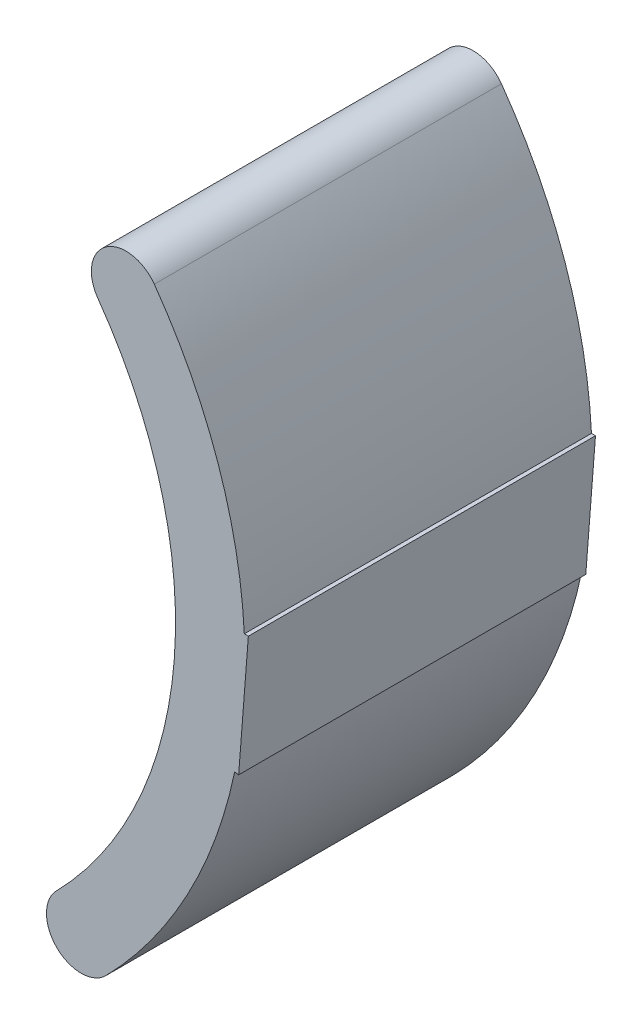
ISO-10303-21;
HEADER;
FILE_DESCRIPTION(('STEP AP214'),'2;1');
FILE_NAME('part.step','',(''),(''),'','','');
FILE_SCHEMA(('AUTOMOTIVE_DESIGN { 1 0 10303 214 1 1 1 1 }'));
ENDSEC;
DATA;
#1=APPLICATION_CONTEXT('core data for automotive mechanical design processes');
#2=APPLICATION_PROTOCOL_DEFINITION('international standard','automotive_design',2000,#1);
#3=PRODUCT_CONTEXT('',#1,'mechanical');
#4=PRODUCT('Part','Part','',(#3));
#5=PRODUCT_RELATED_PRODUCT_CATEGORY('part','',(#4));
#6=PRODUCT_DEFINITION_FORMATION('','',#4);
#7=PRODUCT_DEFINITION_CONTEXT('part definition',#1,'design');
#8=PRODUCT_DEFINITION('design','',#6,#7);
#9=PRODUCT_DEFINITION_SHAPE('','',#8);
#10=(LENGTH_UNIT() NAMED_UNIT(*) SI_UNIT(.MILLI.,.METRE.));
#11=(NAMED_UNIT(*) PLANE_ANGLE_UNIT() SI_UNIT($,.RADIAN.));
#12=(NAMED_UNIT(*) SI_UNIT($,.STERADIAN.) SOLID_ANGLE_UNIT());
#13=UNCERTAINTY_MEASURE_WITH_UNIT(LENGTH_MEASURE(1.E-05),#10,'distance_accuracy_value','');
#14=(GEOMETRIC_REPRESENTATION_CONTEXT(3) GLOBAL_UNCERTAINTY_ASSIGNED_CONTEXT((#13)) GLOBAL_UNIT_ASSIGNED_CONTEXT((#10,
#11,#12)) REPRESENTATION_CONTEXT('',''));
#15=CARTESIAN_POINT('',(0.,0.,0.));
#16=DIRECTION('',(0.,0.,1.));
#17=DIRECTION('',(1.,0.,0.));
#18=AXIS2_PLACEMENT_3D('',#15,#16,#17);
#19=CARTESIAN_POINT('',(46.4110109557855,-45.5084394597524,50.));
#20=DIRECTION('',(0.,0.,-1.));
#21=DIRECTION('',(-1.,0.,0.));
#22=AXIS2_PLACEMENT_3D('',#19,#20,#21);
#23=CYLINDRICAL_SURFACE('',#22,5.);
#24=CARTESIAN_POINT('',(46.4110109557855,-45.5084394597524,0.));
#25=DIRECTION('',(0.,0.,1.));
#26=DIRECTION('',(1.,0.,0.));
#27=AXIS2_PLACEMENT_3D('',#24,#25,#26);
#28=CIRCLE('',#27,5.);
#29=CARTESIAN_POINT('',(42.8409331899559,-42.0077902705407,0.));
#30=VERTEX_POINT('',#29);
#31=CARTESIAN_POINT('',(49.9810887216152,-49.0090886489642,0.));
#32=VERTEX_POINT('',#31);
#33=EDGE_CURVE('E140',#30,#32,#28,.T.);
#34=ORIENTED_EDGE('',*,*,#33,.T.);
#35=DIRECTION('',(0.,0.,-1.));
#36=VECTOR('',#35,1.);
#37=CARTESIAN_POINT('',(49.9810887216152,-49.0090886489642,50.));
#38=LINE('',#37,#36);
#39=CARTESIAN_POINT('',(49.9810887216152,-49.0090886489642,50.));
#40=VERTEX_POINT('',#39);
#41=EDGE_CURVE('E11',#40,#32,#38,.T.);
#42=ORIENTED_EDGE('',*,*,#41,.F.);
#43=CARTESIAN_POINT('',(46.4110109557855,-45.5084394597524,50.));
#44=DIRECTION('',(0.,0.,1.));
#45=DIRECTION('',(1.,0.,0.));
#46=AXIS2_PLACEMENT_3D('',#43,#44,#45);
#47=CIRCLE('',#46,5.);
#48=CARTESIAN_POINT('',(42.8409331899559,-42.0077902705407,50.));
#49=VERTEX_POINT('',#48);
#50=EDGE_CURVE('E162',#49,#40,#47,.T.);
#51=ORIENTED_EDGE('',*,*,#50,.F.);
#52=DIRECTION('',(0.,0.,-1.));
#53=VECTOR('',#52,1.);
#54=CARTESIAN_POINT('',(42.8409331899559,-42.0077902705407,50.));
#55=LINE('',#54,#53);
#56=EDGE_CURVE('E136',#49,#30,#55,.T.);
#57=ORIENTED_EDGE('',*,*,#56,.T.);
#58=EDGE_LOOP('',(#34,#42,#51,#57));
#59=FACE_BOUND('',#58,.T.);
#60=ADVANCED_FACE('F39',(#59),#23,.T.);
#61=CARTESIAN_POINT('',(0.,0.,50.));
#62=DIRECTION('',(0.,0.,-1.));
#63=DIRECTION('',(-1.,0.,0.));
#64=AXIS2_PLACEMENT_3D('',#61,#62,#63);
#65=CYLINDRICAL_SURFACE('',#64,70.);
#66=CARTESIAN_POINT('',(0.,0.,0.));
#67=DIRECTION('',(0.,0.,1.));
#68=DIRECTION('',(1.,0.,0.));
#69=AXIS2_PLACEMENT_3D('',#66,#67,#68);
#70=CIRCLE('',#69,70.);
#71=CARTESIAN_POINT('',(68.5182827752891,-14.3263716804193,0.));
#72=VERTEX_POINT('',#71);
#73=EDGE_CURVE('E144',#32,#72,#70,.T.);
#74=ORIENTED_EDGE('',*,*,#73,.T.);
#75=DIRECTION('',(0.,0.,-1.));
#76=VECTOR('',#75,1.);
#77=CARTESIAN_POINT('',(68.5182827752891,-14.3263716804193,50.));
#78=LINE('',#77,#76);
#79=CARTESIAN_POINT('',(68.5182827752891,-14.3263716804193,50.));
#80=VERTEX_POINT('',#79);
#81=EDGE_CURVE('E48',#80,#72,#78,.T.);
#82=ORIENTED_EDGE('',*,*,#81,.F.);
#83=CARTESIAN_POINT('',(0.,0.,50.));
#84=DIRECTION('',(0.,0.,1.));
#85=DIRECTION('',(1.,0.,0.));
#86=AXIS2_PLACEMENT_3D('',#83,#84,#85);
#87=CIRCLE('',#86,70.);
#88=EDGE_CURVE('E99',#40,#80,#87,.T.);
#89=ORIENTED_EDGE('',*,*,#88,.F.);
#90=ORIENTED_EDGE('',*,*,#41,.T.);
#91=EDGE_LOOP('',(#74,#82,#89,#90));
#92=FACE_BOUND('',#91,.T.);
#93=ADVANCED_FACE('F208',(#92),#65,.T.);
#94=CARTESIAN_POINT('',(69.0917446541184,-14.4159154729665,50.));
#95=DIRECTION('',(0.154276597047051,0.988027697791707,0.));
#96=DIRECTION('',(-0.988027697791708,0.154276597047051,0.));
#97=AXIS2_PLACEMENT_3D('',#94,#95,#96);
#98=PLANE('',#97);
#99=DIRECTION('',(0.988027697791707,-0.154276597047051,0.));
#100=VECTOR('',#99,1.);
#101=CARTESIAN_POINT('',(69.0917446541184,-14.4159154729665,0.));
#102=LINE('',#101,#100);
#103=CARTESIAN_POINT('',(69.0917446541184,-14.4159154729665,0.));
#104=VERTEX_POINT('',#103);
#105=EDGE_CURVE('E147',#72,#104,#102,.T.);
#106=ORIENTED_EDGE('',*,*,#105,.T.);
#107=DIRECTION('',(0.,0.,-1.));
#108=VECTOR('',#107,1.);
#109=CARTESIAN_POINT('',(69.0917446541184,-14.4159154729665,50.));
#110=LINE('',#109,#108);
#111=CARTESIAN_POINT('',(69.0917446541184,-14.4159154729665,50.));
#112=VERTEX_POINT('',#111);
#113=EDGE_CURVE('E173',#112,#104,#110,.T.);
#114=ORIENTED_EDGE('',*,*,#113,.F.);
#115=DIRECTION('',(0.988027697791707,-0.154276597047051,0.));
#116=VECTOR('',#115,1.);
#117=CARTESIAN_POINT('',(69.0917446541184,-14.4159154729665,50.));
#118=LINE('',#117,#116);
#119=EDGE_CURVE('E183',#80,#112,#118,.T.);
#120=ORIENTED_EDGE('',*,*,#119,.F.);
#121=ORIENTED_EDGE('',*,*,#81,.T.);
#122=EDGE_LOOP('',(#106,#114,#120,#121));
#123=FACE_BOUND('',#122,.T.);
#124=ADVANCED_FACE('F181',(#123),#98,.F.);
#125=CARTESIAN_POINT('',(69.0917446541184,-14.4159154729665,50.));
#126=DIRECTION('',(-0.997002431740191,0.0773702210423787,0.));
#127=DIRECTION('',(-0.0773702210423787,-0.997002431740191,0.));
#128=AXIS2_PLACEMENT_3D('',#125,#126,#127);
#129=PLANE('',#128);
#130=DIRECTION('',(0.0773702210423787,0.997002431740191,0.));
#131=VECTOR('',#130,1.);
#132=CARTESIAN_POINT('',(69.0917446541184,-14.4159154729665,0.));
#133=LINE('',#132,#131);
#134=CARTESIAN_POINT('',(70.4885957895083,3.5840845270335,0.));
#135=VERTEX_POINT('',#134);
#136=EDGE_CURVE('E150',#104,#135,#133,.T.);
#137=ORIENTED_EDGE('',*,*,#136,.T.);
#138=DIRECTION('',(0.,0.,-1.));
#139=VECTOR('',#138,1.);
#140=CARTESIAN_POINT('',(70.4885957895083,3.5840845270335,50.));
#141=LINE('',#140,#139);
#142=CARTESIAN_POINT('',(70.4885957895083,3.5840845270335,50.));
#143=VERTEX_POINT('',#142);
#144=EDGE_CURVE('E169',#143,#135,#141,.T.);
#145=ORIENTED_EDGE('',*,*,#144,.F.);
#146=DIRECTION('',(0.0773702210423787,0.997002431740191,0.));
#147=VECTOR('',#146,1.);
#148=CARTESIAN_POINT('',(69.0917446541184,-14.4159154729665,50.));
#149=LINE('',#148,#147);
#150=EDGE_CURVE('E196',#112,#143,#149,.T.);
#151=ORIENTED_EDGE('',*,*,#150,.F.);
#152=ORIENTED_EDGE('',*,*,#113,.T.);
#153=EDGE_LOOP('',(#137,#145,#151,#152));
#154=FACE_BOUND('',#153,.T.);
#155=ADVANCED_FACE('F191',(#154),#129,.F.);
#156=CARTESIAN_POINT('',(70.4885957895083,3.5840845270335,50.));
#157=DIRECTION('',(0.,-1.,0.));
#158=DIRECTION('',(0.,0.,-1.));
#159=AXIS2_PLACEMENT_3D('',#156,#157,#158);
#160=PLANE('',#159);
#161=DIRECTION('',(-1.,0.,0.));
#162=VECTOR('',#161,1.);
#163=CARTESIAN_POINT('',(70.4885957895083,3.5840845270335,0.));
#164=LINE('',#163,#162);
#165=CARTESIAN_POINT('',(69.9081850579964,3.5840845270335,0.));
#166=VERTEX_POINT('',#165);
#167=EDGE_CURVE('E153',#135,#166,#164,.T.);
#168=ORIENTED_EDGE('',*,*,#167,.T.);
#169=DIRECTION('',(0.,0.,-1.));
#170=VECTOR('',#169,1.);
#171=CARTESIAN_POINT('',(69.9081850579964,3.5840845270335,50.));
#172=LINE('',#171,#170);
#173=CARTESIAN_POINT('',(69.9081850579964,3.5840845270335,50.));
#174=VERTEX_POINT('',#173);
#175=EDGE_CURVE('E129',#174,#166,#172,.T.);
#176=ORIENTED_EDGE('',*,*,#175,.F.);
#177=DIRECTION('',(-1.,0.,0.));
#178=VECTOR('',#177,1.);
#179=CARTESIAN_POINT('',(70.4885957895083,3.5840845270335,50.));
#180=LINE('',#179,#178);
#181=EDGE_CURVE('E118',#143,#174,#180,.T.);
#182=ORIENTED_EDGE('',*,*,#181,.F.);
#183=ORIENTED_EDGE('',*,*,#144,.T.);
#184=EDGE_LOOP('',(#168,#176,#182,#183));
#185=FACE_BOUND('',#184,.T.);
#186=ADVANCED_FACE('F194',(#185),#160,.F.);
#187=CARTESIAN_POINT('',(0.,0.,50.));
#188=DIRECTION('',(0.,0.,-1.));
#189=DIRECTION('',(-1.,0.,0.));
#190=AXIS2_PLACEMENT_3D('',#187,#188,#189);
#191=CYLINDRICAL_SURFACE('',#190,70.);
#192=CARTESIAN_POINT('',(0.,0.,0.));
#193=DIRECTION('',(0.,0.,1.));
#194=DIRECTION('',(1.,0.,0.));
#195=AXIS2_PLACEMENT_3D('',#192,#193,#194);
#196=CIRCLE('',#195,70.);
#197=CARTESIAN_POINT('',(56.94365544388,40.7114247440282,0.));
#198=VERTEX_POINT('',#197);
#199=EDGE_CURVE('E127',#166,#198,#196,.T.);
#200=ORIENTED_EDGE('',*,*,#199,.T.);
#201=DIRECTION('',(0.,0.,-1.));
#202=VECTOR('',#201,1.);
#203=CARTESIAN_POINT('',(56.94365544388,40.7114247440282,50.));
#204=LINE('',#203,#202);
#205=CARTESIAN_POINT('',(56.94365544388,40.7114247440282,50.));
#206=VERTEX_POINT('',#205);
#207=EDGE_CURVE('E124',#206,#198,#204,.T.);
#208=ORIENTED_EDGE('',*,*,#207,.F.);
#209=CARTESIAN_POINT('',(0.,0.,50.));
#210=DIRECTION('',(0.,0.,1.));
#211=DIRECTION('',(1.,0.,0.));
#212=AXIS2_PLACEMENT_3D('',#209,#210,#211);
#213=CIRCLE('',#212,70.);
#214=EDGE_CURVE('E112',#174,#206,#213,.T.);
#215=ORIENTED_EDGE('',*,*,#214,.F.);
#216=ORIENTED_EDGE('',*,*,#175,.T.);
#217=EDGE_LOOP('',(#200,#208,#215,#216));
#218=FACE_BOUND('',#217,.T.);
#219=ADVANCED_FACE('F125',(#218),#191,.T.);
#220=CARTESIAN_POINT('',(52.8762514836029,37.8034658337405,50.));
#221=DIRECTION('',(0.,0.,-1.));
#222=DIRECTION('',(-1.,0.,0.));
#223=AXIS2_PLACEMENT_3D('',#220,#221,#222);
#224=CYLINDRICAL_SURFACE('',#223,5.);
#225=CARTESIAN_POINT('',(52.8762514836029,37.8034658337405,0.));
#226=DIRECTION('',(0.,0.,1.));
#227=DIRECTION('',(-1.,0.,0.));
#228=AXIS2_PLACEMENT_3D('',#225,#226,#227);
#229=CIRCLE('',#228,5.);
#230=CARTESIAN_POINT('',(48.8088475233257,34.8955069234527,0.));
#231=VERTEX_POINT('',#230);
#232=EDGE_CURVE('E85',#198,#231,#229,.T.);
#233=ORIENTED_EDGE('',*,*,#232,.T.);
#234=DIRECTION('',(0.,0.,-1.));
#235=VECTOR('',#234,1.);
#236=CARTESIAN_POINT('',(48.8088475233257,34.8955069234527,50.));
#237=LINE('',#236,#235);
#238=CARTESIAN_POINT('',(48.8088475233257,34.8955069234527,50.));
#239=VERTEX_POINT('',#238);
#240=EDGE_CURVE('E130',#239,#231,#237,.T.);
#241=ORIENTED_EDGE('',*,*,#240,.F.);
#242=CARTESIAN_POINT('',(52.8762514836029,37.8034658337405,50.));
#243=DIRECTION('',(0.,0.,1.));
#244=DIRECTION('',(-1.,0.,0.));
#245=AXIS2_PLACEMENT_3D('',#242,#243,#244);
#246=CIRCLE('',#245,5.);
#247=EDGE_CURVE('E116',#206,#239,#246,.T.);
#248=ORIENTED_EDGE('',*,*,#247,.F.);
#249=ORIENTED_EDGE('',*,*,#207,.T.);
#250=EDGE_LOOP('',(#233,#241,#248,#249));
#251=FACE_BOUND('',#250,.T.);
#252=ADVANCED_FACE('F132',(#251),#224,.T.);
#253=CARTESIAN_POINT('',(0.,0.,50.));
#254=DIRECTION('',(0.,0.,-1.));
#255=DIRECTION('',(-1.,0.,0.));
#256=AXIS2_PLACEMENT_3D('',#253,#254,#255);
#257=CYLINDRICAL_SURFACE('',#256,60.);
#258=CARTESIAN_POINT('',(0.,0.,0.));
#259=DIRECTION('',(0.,0.,-1.));
#260=DIRECTION('',(1.,0.,0.));
#261=AXIS2_PLACEMENT_3D('',#258,#259,#260);
#262=CIRCLE('',#261,60.);
#263=EDGE_CURVE('E91',#231,#30,#262,.T.);
#264=ORIENTED_EDGE('',*,*,#263,.T.);
#265=ORIENTED_EDGE('',*,*,#56,.F.);
#266=CARTESIAN_POINT('',(0.,0.,50.));
#267=DIRECTION('',(0.,0.,-1.));
#268=DIRECTION('',(1.,0.,0.));
#269=AXIS2_PLACEMENT_3D('',#266,#267,#268);
#270=CIRCLE('',#269,60.);
#271=EDGE_CURVE('E56',#239,#49,#270,.T.);
#272=ORIENTED_EDGE('',*,*,#271,.F.);
#273=ORIENTED_EDGE('',*,*,#240,.T.);
#274=EDGE_LOOP('',(#264,#265,#272,#273));
#275=FACE_BOUND('',#274,.T.);
#276=ADVANCED_FACE('F224',(#275),#257,.F.);
#277=CARTESIAN_POINT('',(46.4110109557855,-45.5084394597524,50.));
#278=DIRECTION('',(0.,0.,1.));
#279=DIRECTION('',(1.,0.,0.));
#280=AXIS2_PLACEMENT_3D('',#277,#278,#279);
#281=PLANE('',#280);
#282=ORIENTED_EDGE('',*,*,#50,.T.);
#283=ORIENTED_EDGE('',*,*,#88,.T.);
#284=ORIENTED_EDGE('',*,*,#119,.T.);
#285=ORIENTED_EDGE('',*,*,#150,.T.);
#286=ORIENTED_EDGE('',*,*,#181,.T.);
#287=ORIENTED_EDGE('',*,*,#214,.T.);
#288=ORIENTED_EDGE('',*,*,#247,.T.);
#289=ORIENTED_EDGE('',*,*,#271,.T.);
#290=EDGE_LOOP('',(#282,#283,#284,#285,#286,#287,#288,#289));
#291=FACE_BOUND('',#290,.T.);
#292=ADVANCED_FACE('F114',(#291),#281,.T.);
#293=CARTESIAN_POINT('',(46.4110109557855,-45.5084394597524,0.));
#294=DIRECTION('',(0.,0.,1.));
#295=DIRECTION('',(1.,0.,0.));
#296=AXIS2_PLACEMENT_3D('',#293,#294,#295);
#297=PLANE('',#296);
#298=ORIENTED_EDGE('',*,*,#33,.F.);
#299=ORIENTED_EDGE('',*,*,#263,.F.);
#300=ORIENTED_EDGE('',*,*,#232,.F.);
#301=ORIENTED_EDGE('',*,*,#199,.F.);
#302=ORIENTED_EDGE('',*,*,#167,.F.);
#303=ORIENTED_EDGE('',*,*,#136,.F.);
#304=ORIENTED_EDGE('',*,*,#105,.F.);
#305=ORIENTED_EDGE('',*,*,#73,.F.);
#306=EDGE_LOOP('',(#298,#299,#300,#301,#302,#303,#304,#305));
#307=FACE_BOUND('',#306,.T.);
#308=ADVANCED_FACE('F187',(#307),#297,.F.);
#309=CLOSED_SHELL('',(#60,#93,#124,#155,#186,#219,#252,#276,#292,#308));
#310=MANIFOLD_SOLID_BREP('B2',#309);
#311=ADVANCED_BREP_SHAPE_REPRESENTATION('',(#18,#310),#14);
#312=SHAPE_DEFINITION_REPRESENTATION(#9,#311);
ENDSEC;
END-ISO-10303-21;
